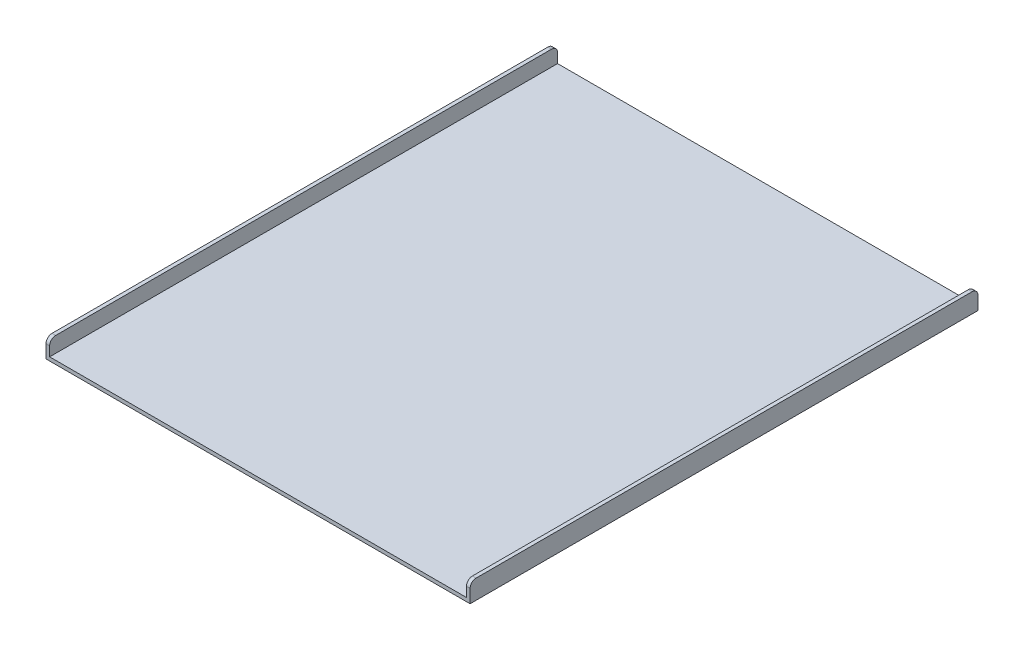
ISO-10303-21;
HEADER;
FILE_DESCRIPTION(('STEP AP214'),'2;1');
FILE_NAME('part.step','',(''),(''),'','','');
FILE_SCHEMA(('AUTOMOTIVE_DESIGN { 1 0 10303 214 1 1 1 1 }'));
ENDSEC;
DATA;
#1=APPLICATION_CONTEXT('core data for automotive mechanical design processes');
#2=APPLICATION_PROTOCOL_DEFINITION('international standard','automotive_design',2000,#1);
#3=PRODUCT_CONTEXT('',#1,'mechanical');
#4=PRODUCT('Part','Part','',(#3));
#5=PRODUCT_RELATED_PRODUCT_CATEGORY('part','',(#4));
#6=PRODUCT_DEFINITION_FORMATION('','',#4);
#7=PRODUCT_DEFINITION_CONTEXT('part definition',#1,'design');
#8=PRODUCT_DEFINITION('design','',#6,#7);
#9=PRODUCT_DEFINITION_SHAPE('','',#8);
#10=(LENGTH_UNIT() NAMED_UNIT(*) SI_UNIT(.MILLI.,.METRE.));
#11=(NAMED_UNIT(*) PLANE_ANGLE_UNIT() SI_UNIT($,.RADIAN.));
#12=(NAMED_UNIT(*) SI_UNIT($,.STERADIAN.) SOLID_ANGLE_UNIT());
#13=UNCERTAINTY_MEASURE_WITH_UNIT(LENGTH_MEASURE(1.E-05),#10,'distance_accuracy_value','');
#14=(GEOMETRIC_REPRESENTATION_CONTEXT(3) GLOBAL_UNCERTAINTY_ASSIGNED_CONTEXT((#13)) GLOBAL_UNIT_ASSIGNED_CONTEXT((#10,
#11,#12)) REPRESENTATION_CONTEXT('',''));
#15=CARTESIAN_POINT('',(0.,0.,0.));
#16=DIRECTION('',(0.,0.,1.));
#17=DIRECTION('',(1.,0.,0.));
#18=AXIS2_PLACEMENT_3D('',#15,#16,#17);
#19=CARTESIAN_POINT('',(446.551474958623,0.,421.049210887177));
#20=DIRECTION('',(-1.,0.,0.));
#21=DIRECTION('',(0.,0.,1.));
#22=AXIS2_PLACEMENT_3D('',#19,#20,#21);
#23=PLANE('',#22);
#24=DIRECTION('',(0.,1.,0.));
#25=VECTOR('',#24,1.);
#26=CARTESIAN_POINT('',(446.551474958623,0.,-421.049210887177));
#27=LINE('',#26,#25);
#28=CARTESIAN_POINT('',(446.551474958623,-6.04818389811423,-421.049210887177));
#29=VERTEX_POINT('',#28);
#30=CARTESIAN_POINT('',(446.551474958623,15.9156712813162,-421.049210887177));
#31=VERTEX_POINT('',#30);
#32=EDGE_CURVE('E165',#29,#31,#27,.T.);
#33=ORIENTED_EDGE('',*,*,#32,.T.);
#34=CARTESIAN_POINT('',(446.551474958623,15.9156712813162,-411.049210887177));
#35=DIRECTION('',(-1.,0.,0.));
#36=DIRECTION('',(0.,0.,1.));
#37=AXIS2_PLACEMENT_3D('',#34,#35,#36);
#38=CIRCLE('',#37,10.);
#39=CARTESIAN_POINT('',(446.551474958623,25.9156712813162,-411.049210887177));
#40=VERTEX_POINT('',#39);
#41=EDGE_CURVE('E214',#31,#40,#38,.F.);
#42=ORIENTED_EDGE('',*,*,#41,.T.);
#43=DIRECTION('',(0.,0.,-1.));
#44=VECTOR('',#43,1.);
#45=CARTESIAN_POINT('',(446.551474958623,25.9156712813162,421.049210887177));
#46=LINE('',#45,#44);
#47=CARTESIAN_POINT('',(446.551474958623,25.9156712813162,411.049210887177));
#48=VERTEX_POINT('',#47);
#49=EDGE_CURVE('E191',#48,#40,#46,.T.);
#50=ORIENTED_EDGE('',*,*,#49,.F.);
#51=CARTESIAN_POINT('',(446.551474958623,15.9156712813162,411.049210887177));
#52=DIRECTION('',(-1.,0.,0.));
#53=DIRECTION('',(0.,0.,1.));
#54=AXIS2_PLACEMENT_3D('',#51,#52,#53);
#55=CIRCLE('',#54,10.);
#56=CARTESIAN_POINT('',(446.551474958623,15.9156712813162,421.049210887177));
#57=VERTEX_POINT('',#56);
#58=EDGE_CURVE('E212',#48,#57,#55,.F.);
#59=ORIENTED_EDGE('',*,*,#58,.T.);
#60=DIRECTION('',(0.,1.,0.));
#61=VECTOR('',#60,1.);
#62=CARTESIAN_POINT('',(446.551474958623,0.,421.049210887177));
#63=LINE('',#62,#61);
#64=CARTESIAN_POINT('',(446.551474958623,-6.04818389811423,421.049210887177));
#65=VERTEX_POINT('',#64);
#66=EDGE_CURVE('E150',#65,#57,#63,.T.);
#67=ORIENTED_EDGE('',*,*,#66,.F.);
#68=DIRECTION('',(0.,0.,-1.));
#69=VECTOR('',#68,1.);
#70=CARTESIAN_POINT('',(446.551474958623,-6.04818389811423,421.049210887177));
#71=LINE('',#70,#69);
#72=EDGE_CURVE('E164',#65,#29,#71,.T.);
#73=ORIENTED_EDGE('',*,*,#72,.T.);
#74=EDGE_LOOP('',(#33,#42,#50,#59,#67,#73));
#75=FACE_BOUND('',#74,.T.);
#76=ADVANCED_FACE('F41',(#75),#23,.F.);
#77=CARTESIAN_POINT('',(440.503291060509,25.9156712813162,421.049210887177));
#78=DIRECTION('',(0.,1.,0.));
#79=DIRECTION('',(0.,0.,1.));
#80=AXIS2_PLACEMENT_3D('',#77,#78,#79);
#81=PLANE('',#80);
#82=ORIENTED_EDGE('',*,*,#49,.T.);
#83=DIRECTION('',(1.,0.,0.));
#84=VECTOR('',#83,1.);
#85=CARTESIAN_POINT('',(440.503291060509,25.9156712813162,-411.049210887177));
#86=LINE('',#85,#84);
#87=CARTESIAN_POINT('',(440.503291060509,25.9156712813162,-411.049210887177));
#88=VERTEX_POINT('',#87);
#89=EDGE_CURVE('E64',#40,#88,#86,.F.);
#90=ORIENTED_EDGE('',*,*,#89,.T.);
#91=DIRECTION('',(0.,0.,-1.));
#92=VECTOR('',#91,1.);
#93=CARTESIAN_POINT('',(440.503291060509,25.9156712813162,421.049210887177));
#94=LINE('',#93,#92);
#95=CARTESIAN_POINT('',(440.503291060509,25.9156712813162,411.049210887177));
#96=VERTEX_POINT('',#95);
#97=EDGE_CURVE('E143',#96,#88,#94,.T.);
#98=ORIENTED_EDGE('',*,*,#97,.F.);
#99=DIRECTION('',(1.,0.,0.));
#100=VECTOR('',#99,1.);
#101=CARTESIAN_POINT('',(446.551474958623,25.9156712813162,411.049210887177));
#102=LINE('',#101,#100);
#103=EDGE_CURVE('E216',#96,#48,#102,.T.);
#104=ORIENTED_EDGE('',*,*,#103,.T.);
#105=EDGE_LOOP('',(#82,#90,#98,#104));
#106=FACE_BOUND('',#105,.T.);
#107=ADVANCED_FACE('F252',(#106),#81,.T.);
#108=CARTESIAN_POINT('',(440.503291060509,0.,421.049210887177));
#109=DIRECTION('',(-1.,0.,0.));
#110=DIRECTION('',(0.,0.,1.));
#111=AXIS2_PLACEMENT_3D('',#108,#109,#110);
#112=PLANE('',#111);
#113=ORIENTED_EDGE('',*,*,#97,.T.);
#114=CARTESIAN_POINT('',(440.503291060509,15.9156712813162,-411.049210887177));
#115=DIRECTION('',(-1.,0.,0.));
#116=DIRECTION('',(0.,0.,1.));
#117=AXIS2_PLACEMENT_3D('',#114,#115,#116);
#118=CIRCLE('',#117,10.);
#119=CARTESIAN_POINT('',(440.503291060509,15.9156712813162,-421.049210887177));
#120=VERTEX_POINT('',#119);
#121=EDGE_CURVE('E222',#88,#120,#118,.T.);
#122=ORIENTED_EDGE('',*,*,#121,.T.);
#123=DIRECTION('',(0.,1.,0.));
#124=VECTOR('',#123,1.);
#125=CARTESIAN_POINT('',(440.503291060509,0.,-421.049210887177));
#126=LINE('',#125,#124);
#127=CARTESIAN_POINT('',(440.503291060509,0.,-421.049210887177));
#128=VERTEX_POINT('',#127);
#129=EDGE_CURVE('E138',#128,#120,#126,.T.);
#130=ORIENTED_EDGE('',*,*,#129,.F.);
#131=DIRECTION('',(0.,0.,-1.));
#132=VECTOR('',#131,1.);
#133=CARTESIAN_POINT('',(440.503291060509,0.,421.049210887177));
#134=LINE('',#133,#132);
#135=CARTESIAN_POINT('',(440.503291060509,0.,421.049210887177));
#136=VERTEX_POINT('',#135);
#137=EDGE_CURVE('E133',#136,#128,#134,.T.);
#138=ORIENTED_EDGE('',*,*,#137,.F.);
#139=DIRECTION('',(0.,1.,0.));
#140=VECTOR('',#139,1.);
#141=CARTESIAN_POINT('',(440.503291060509,0.,421.049210887177));
#142=LINE('',#141,#140);
#143=CARTESIAN_POINT('',(440.503291060509,15.9156712813162,421.049210887177));
#144=VERTEX_POINT('',#143);
#145=EDGE_CURVE('E135',#136,#144,#142,.T.);
#146=ORIENTED_EDGE('',*,*,#145,.T.);
#147=CARTESIAN_POINT('',(440.503291060509,15.9156712813162,411.049210887177));
#148=DIRECTION('',(-1.,0.,0.));
#149=DIRECTION('',(0.,0.,1.));
#150=AXIS2_PLACEMENT_3D('',#147,#148,#149);
#151=CIRCLE('',#150,10.);
#152=EDGE_CURVE('E220',#144,#96,#151,.T.);
#153=ORIENTED_EDGE('',*,*,#152,.T.);
#154=EDGE_LOOP('',(#113,#122,#130,#138,#146,#153));
#155=FACE_BOUND('',#154,.T.);
#156=ADVANCED_FACE('F134',(#155),#112,.T.);
#157=CARTESIAN_POINT('',(-250.514148936986,0.,421.049210887177));
#158=DIRECTION('',(0.,1.,0.));
#159=DIRECTION('',(0.,0.,1.));
#160=AXIS2_PLACEMENT_3D('',#157,#158,#159);
#161=PLANE('',#160);
#162=DIRECTION('',(1.,0.,0.));
#163=VECTOR('',#162,1.);
#164=CARTESIAN_POINT('',(-250.514148936986,0.,-421.049210887177));
#165=LINE('',#164,#163);
#166=CARTESIAN_POINT('',(-250.514148936986,0.,-421.049210887177));
#167=VERTEX_POINT('',#166);
#168=EDGE_CURVE('E170',#167,#128,#165,.T.);
#169=ORIENTED_EDGE('',*,*,#168,.F.);
#170=DIRECTION('',(0.,0.,-1.));
#171=VECTOR('',#170,1.);
#172=CARTESIAN_POINT('',(-250.514148936986,0.,421.049210887177));
#173=LINE('',#172,#171);
#174=CARTESIAN_POINT('',(-250.514148936986,0.,421.049210887177));
#175=VERTEX_POINT('',#174);
#176=EDGE_CURVE('E144',#175,#167,#173,.T.);
#177=ORIENTED_EDGE('',*,*,#176,.F.);
#178=DIRECTION('',(1.,0.,0.));
#179=VECTOR('',#178,1.);
#180=CARTESIAN_POINT('',(-250.514148936986,0.,421.049210887177));
#181=LINE('',#180,#179);
#182=EDGE_CURVE('E149',#175,#136,#181,.T.);
#183=ORIENTED_EDGE('',*,*,#182,.T.);
#184=ORIENTED_EDGE('',*,*,#137,.T.);
#185=EDGE_LOOP('',(#169,#177,#183,#184));
#186=FACE_BOUND('',#185,.T.);
#187=ADVANCED_FACE('F153',(#186),#161,.T.);
#188=CARTESIAN_POINT('',(-250.514148936986,25.7536347583907,421.049210887177));
#189=DIRECTION('',(1.,0.,0.));
#190=DIRECTION('',(0.,0.,-1.));
#191=AXIS2_PLACEMENT_3D('',#188,#189,#190);
#192=PLANE('',#191);
#193=DIRECTION('',(0.,-1.,0.));
#194=VECTOR('',#193,1.);
#195=CARTESIAN_POINT('',(-250.514148936986,25.7536347583907,-421.049210887177));
#196=LINE('',#195,#194);
#197=CARTESIAN_POINT('',(-250.514148936986,15.7536347583907,-421.049210887177));
#198=VERTEX_POINT('',#197);
#199=EDGE_CURVE('E172',#198,#167,#196,.T.);
#200=ORIENTED_EDGE('',*,*,#199,.F.);
#201=CARTESIAN_POINT('',(-250.514148936986,15.7536347583907,-411.049210887177));
#202=DIRECTION('',(1.,0.,0.));
#203=DIRECTION('',(0.,0.,-1.));
#204=AXIS2_PLACEMENT_3D('',#201,#202,#203);
#205=CIRCLE('',#204,10.);
#206=CARTESIAN_POINT('',(-250.514148936986,25.7536347583907,-411.049210887177));
#207=VERTEX_POINT('',#206);
#208=EDGE_CURVE('E201',#198,#207,#205,.T.);
#209=ORIENTED_EDGE('',*,*,#208,.T.);
#210=DIRECTION('',(0.,0.,-1.));
#211=VECTOR('',#210,1.);
#212=CARTESIAN_POINT('',(-250.514148936986,25.7536347583907,421.049210887177));
#213=LINE('',#212,#211);
#214=CARTESIAN_POINT('',(-250.514148936986,25.7536347583907,411.049210887177));
#215=VERTEX_POINT('',#214);
#216=EDGE_CURVE('E186',#215,#207,#213,.T.);
#217=ORIENTED_EDGE('',*,*,#216,.F.);
#218=CARTESIAN_POINT('',(-250.514148936986,15.7536347583907,411.049210887177));
#219=DIRECTION('',(1.,0.,0.));
#220=DIRECTION('',(0.,0.,-1.));
#221=AXIS2_PLACEMENT_3D('',#218,#219,#220);
#222=CIRCLE('',#221,10.);
#223=CARTESIAN_POINT('',(-250.514148936986,15.7536347583907,421.049210887177));
#224=VERTEX_POINT('',#223);
#225=EDGE_CURVE('E199',#215,#224,#222,.T.);
#226=ORIENTED_EDGE('',*,*,#225,.T.);
#227=DIRECTION('',(0.,-1.,0.));
#228=VECTOR('',#227,1.);
#229=CARTESIAN_POINT('',(-250.514148936986,25.7536347583907,421.049210887177));
#230=LINE('',#229,#228);
#231=EDGE_CURVE('E155',#224,#175,#230,.T.);
#232=ORIENTED_EDGE('',*,*,#231,.T.);
#233=ORIENTED_EDGE('',*,*,#176,.T.);
#234=EDGE_LOOP('',(#200,#209,#217,#226,#232,#233));
#235=FACE_BOUND('',#234,.T.);
#236=ADVANCED_FACE('F315',(#235),#192,.T.);
#237=CARTESIAN_POINT('',(-256.5623328351,25.7536347583907,421.049210887177));
#238=DIRECTION('',(0.,1.,0.));
#239=DIRECTION('',(0.,0.,1.));
#240=AXIS2_PLACEMENT_3D('',#237,#238,#239);
#241=PLANE('',#240);
#242=ORIENTED_EDGE('',*,*,#216,.T.);
#243=DIRECTION('',(1.,0.,0.));
#244=VECTOR('',#243,1.);
#245=CARTESIAN_POINT('',(-256.5623328351,25.7536347583907,-411.049210887177));
#246=LINE('',#245,#244);
#247=CARTESIAN_POINT('',(-256.5623328351,25.7536347583907,-411.049210887177));
#248=VERTEX_POINT('',#247);
#249=EDGE_CURVE('E206',#207,#248,#246,.F.);
#250=ORIENTED_EDGE('',*,*,#249,.T.);
#251=DIRECTION('',(0.,0.,-1.));
#252=VECTOR('',#251,1.);
#253=CARTESIAN_POINT('',(-256.5623328351,25.7536347583907,421.049210887177));
#254=LINE('',#253,#252);
#255=CARTESIAN_POINT('',(-256.5623328351,25.7536347583907,411.049210887177));
#256=VERTEX_POINT('',#255);
#257=EDGE_CURVE('E183',#256,#248,#254,.T.);
#258=ORIENTED_EDGE('',*,*,#257,.F.);
#259=DIRECTION('',(1.,0.,0.));
#260=VECTOR('',#259,1.);
#261=CARTESIAN_POINT('',(-250.514148936986,25.7536347583907,411.049210887177));
#262=LINE('',#261,#260);
#263=EDGE_CURVE('E203',#256,#215,#262,.T.);
#264=ORIENTED_EDGE('',*,*,#263,.T.);
#265=EDGE_LOOP('',(#242,#250,#258,#264));
#266=FACE_BOUND('',#265,.T.);
#267=ADVANCED_FACE('F309',(#266),#241,.T.);
#268=CARTESIAN_POINT('',(-256.5623328351,25.7536347583907,421.049210887177));
#269=DIRECTION('',(1.,0.,0.));
#270=DIRECTION('',(0.,0.,-1.));
#271=AXIS2_PLACEMENT_3D('',#268,#269,#270);
#272=PLANE('',#271);
#273=ORIENTED_EDGE('',*,*,#257,.T.);
#274=CARTESIAN_POINT('',(-256.5623328351,15.7536347583907,-411.049210887177));
#275=DIRECTION('',(1.,0.,0.));
#276=DIRECTION('',(0.,0.,-1.));
#277=AXIS2_PLACEMENT_3D('',#274,#275,#276);
#278=CIRCLE('',#277,10.);
#279=CARTESIAN_POINT('',(-256.5623328351,15.7536347583907,-421.049210887177));
#280=VERTEX_POINT('',#279);
#281=EDGE_CURVE('E210',#248,#280,#278,.F.);
#282=ORIENTED_EDGE('',*,*,#281,.T.);
#283=DIRECTION('',(0.,1.,0.));
#284=VECTOR('',#283,1.);
#285=CARTESIAN_POINT('',(-256.5623328351,25.7536347583907,-421.049210887177));
#286=LINE('',#285,#284);
#287=CARTESIAN_POINT('',(-256.5623328351,-6.04818389811423,-421.049210887177));
#288=VERTEX_POINT('',#287);
#289=EDGE_CURVE('E174',#280,#288,#286,.F.);
#290=ORIENTED_EDGE('',*,*,#289,.T.);
#291=DIRECTION('',(0.,0.,-1.));
#292=VECTOR('',#291,1.);
#293=CARTESIAN_POINT('',(-256.5623328351,-6.04818389811423,421.049210887177));
#294=LINE('',#293,#292);
#295=CARTESIAN_POINT('',(-256.5623328351,-6.04818389811423,421.049210887177));
#296=VERTEX_POINT('',#295);
#297=EDGE_CURVE('E180',#296,#288,#294,.T.);
#298=ORIENTED_EDGE('',*,*,#297,.F.);
#299=DIRECTION('',(0.,1.,0.));
#300=VECTOR('',#299,1.);
#301=CARTESIAN_POINT('',(-256.5623328351,25.7536347583907,421.049210887177));
#302=LINE('',#301,#300);
#303=CARTESIAN_POINT('',(-256.5623328351,15.7536347583907,421.049210887177));
#304=VERTEX_POINT('',#303);
#305=EDGE_CURVE('E157',#304,#296,#302,.F.);
#306=ORIENTED_EDGE('',*,*,#305,.F.);
#307=CARTESIAN_POINT('',(-256.5623328351,15.7536347583907,411.049210887177));
#308=DIRECTION('',(1.,0.,0.));
#309=DIRECTION('',(0.,0.,-1.));
#310=AXIS2_PLACEMENT_3D('',#307,#308,#309);
#311=CIRCLE('',#310,10.);
#312=EDGE_CURVE('E208',#304,#256,#311,.F.);
#313=ORIENTED_EDGE('',*,*,#312,.T.);
#314=EDGE_LOOP('',(#273,#282,#290,#298,#306,#313));
#315=FACE_BOUND('',#314,.T.);
#316=ADVANCED_FACE('F234',(#315),#272,.F.);
#317=CARTESIAN_POINT('',(-250.514148936986,-6.04818389811423,421.049210887177));
#318=DIRECTION('',(0.,1.,0.));
#319=DIRECTION('',(0.,0.,1.));
#320=AXIS2_PLACEMENT_3D('',#317,#318,#319);
#321=PLANE('',#320);
#322=CARTESIAN_POINT('',(-174.060500889895,-6.04818389811423,351.274172880699));
#323=DIRECTION('',(0.,1.,0.));
#324=DIRECTION('',(0.,0.,1.));
#325=AXIS2_PLACEMENT_3D('',#322,#323,#324);
#326=CIRCLE('',#325,19.0499999999603);
#327=CARTESIAN_POINT('',(-174.060500889895,-6.04818389811423,370.324172880659));
#328=VERTEX_POINT('',#327);
#329=EDGE_CURVE('E12',#328,#328,#326,.F.);
#330=ORIENTED_EDGE('',*,*,#329,.F.);
#331=EDGE_LOOP('',(#330));
#332=FACE_BOUND('',#331,.T.);
#333=CARTESIAN_POINT('',(360.164689426128,-6.04818389811423,-358.012657815124));
#334=DIRECTION('',(0.,1.,0.));
#335=DIRECTION('',(0.,0.,1.));
#336=AXIS2_PLACEMENT_3D('',#333,#334,#335);
#337=CIRCLE('',#336,19.05);
#338=CARTESIAN_POINT('',(360.164689426128,-6.04818389811423,-338.962657815124));
#339=VERTEX_POINT('',#338);
#340=EDGE_CURVE('E49',#339,#339,#337,.F.);
#341=ORIENTED_EDGE('',*,*,#340,.F.);
#342=EDGE_LOOP('',(#341));
#343=FACE_BOUND('',#342,.T.);
#344=DIRECTION('',(1.,0.,0.));
#345=VECTOR('',#344,1.);
#346=CARTESIAN_POINT('',(-250.514148936986,-6.04818389811423,-421.049210887177));
#347=LINE('',#346,#345);
#348=EDGE_CURVE('E176',#288,#29,#347,.T.);
#349=ORIENTED_EDGE('',*,*,#348,.T.);
#350=ORIENTED_EDGE('',*,*,#72,.F.);
#351=DIRECTION('',(1.,0.,0.));
#352=VECTOR('',#351,1.);
#353=CARTESIAN_POINT('',(-250.514148936986,-6.04818389811423,421.049210887177));
#354=LINE('',#353,#352);
#355=EDGE_CURVE('E162',#296,#65,#354,.T.);
#356=ORIENTED_EDGE('',*,*,#355,.F.);
#357=ORIENTED_EDGE('',*,*,#297,.T.);
#358=EDGE_LOOP('',(#349,#350,#356,#357));
#359=FACE_BOUND('',#358,.T.);
#360=ADVANCED_FACE('F231',(#332,#343,#359),#321,.F.);
#361=CARTESIAN_POINT('',(0.,0.,421.049210887177));
#362=DIRECTION('',(0.,0.,-1.));
#363=DIRECTION('',(-1.,0.,0.));
#364=AXIS2_PLACEMENT_3D('',#361,#362,#363);
#365=PLANE('',#364);
#366=ORIENTED_EDGE('',*,*,#66,.T.);
#367=DIRECTION('',(1.,0.,0.));
#368=VECTOR('',#367,1.);
#369=CARTESIAN_POINT('',(440.503291060509,15.9156712813162,421.049210887177));
#370=LINE('',#369,#368);
#371=EDGE_CURVE('E56',#57,#144,#370,.F.);
#372=ORIENTED_EDGE('',*,*,#371,.T.);
#373=ORIENTED_EDGE('',*,*,#145,.F.);
#374=ORIENTED_EDGE('',*,*,#182,.F.);
#375=ORIENTED_EDGE('',*,*,#231,.F.);
#376=DIRECTION('',(1.,0.,0.));
#377=VECTOR('',#376,1.);
#378=CARTESIAN_POINT('',(-256.5623328351,15.7536347583907,421.049210887177));
#379=LINE('',#378,#377);
#380=EDGE_CURVE('E224',#224,#304,#379,.F.);
#381=ORIENTED_EDGE('',*,*,#380,.T.);
#382=ORIENTED_EDGE('',*,*,#305,.T.);
#383=ORIENTED_EDGE('',*,*,#355,.T.);
#384=EDGE_LOOP('',(#366,#372,#373,#374,#375,#381,#382,#383));
#385=FACE_BOUND('',#384,.T.);
#386=ADVANCED_FACE('F147',(#385),#365,.F.);
#387=CARTESIAN_POINT('',(0.,0.,-421.049210887177));
#388=DIRECTION('',(0.,0.,-1.));
#389=DIRECTION('',(-1.,0.,0.));
#390=AXIS2_PLACEMENT_3D('',#387,#388,#389);
#391=PLANE('',#390);
#392=ORIENTED_EDGE('',*,*,#289,.F.);
#393=DIRECTION('',(1.,0.,0.));
#394=VECTOR('',#393,1.);
#395=CARTESIAN_POINT('',(0.,15.7536347583907,-421.049210887177));
#396=LINE('',#395,#394);
#397=EDGE_CURVE('E196',#280,#198,#396,.T.);
#398=ORIENTED_EDGE('',*,*,#397,.T.);
#399=ORIENTED_EDGE('',*,*,#199,.T.);
#400=ORIENTED_EDGE('',*,*,#168,.T.);
#401=ORIENTED_EDGE('',*,*,#129,.T.);
#402=DIRECTION('',(1.,0.,0.));
#403=VECTOR('',#402,1.);
#404=CARTESIAN_POINT('',(0.,15.9156712813162,-421.049210887177));
#405=LINE('',#404,#403);
#406=EDGE_CURVE('E193',#120,#31,#405,.T.);
#407=ORIENTED_EDGE('',*,*,#406,.T.);
#408=ORIENTED_EDGE('',*,*,#32,.F.);
#409=ORIENTED_EDGE('',*,*,#348,.F.);
#410=EDGE_LOOP('',(#392,#398,#399,#400,#401,#407,#408,#409));
#411=FACE_BOUND('',#410,.T.);
#412=ADVANCED_FACE('F246',(#411),#391,.T.);
#413=CARTESIAN_POINT('',(0.,15.7536347583907,-411.049210887177));
#414=DIRECTION('',(1.,0.,0.));
#415=DIRECTION('',(0.,0.,-1.));
#416=AXIS2_PLACEMENT_3D('',#413,#414,#415);
#417=CYLINDRICAL_SURFACE('',#416,10.);
#418=ORIENTED_EDGE('',*,*,#281,.F.);
#419=ORIENTED_EDGE('',*,*,#249,.F.);
#420=ORIENTED_EDGE('',*,*,#208,.F.);
#421=ORIENTED_EDGE('',*,*,#397,.F.);
#422=EDGE_LOOP('',(#418,#419,#420,#421));
#423=FACE_BOUND('',#422,.T.);
#424=ADVANCED_FACE('F286',(#423),#417,.T.);
#425=CARTESIAN_POINT('',(0.,15.9156712813162,-411.049210887177));
#426=DIRECTION('',(1.,0.,0.));
#427=DIRECTION('',(0.,0.,-1.));
#428=AXIS2_PLACEMENT_3D('',#425,#426,#427);
#429=CYLINDRICAL_SURFACE('',#428,10.);
#430=ORIENTED_EDGE('',*,*,#121,.F.);
#431=ORIENTED_EDGE('',*,*,#89,.F.);
#432=ORIENTED_EDGE('',*,*,#41,.F.);
#433=ORIENTED_EDGE('',*,*,#406,.F.);
#434=EDGE_LOOP('',(#430,#431,#432,#433));
#435=FACE_BOUND('',#434,.T.);
#436=ADVANCED_FACE('F250',(#435),#429,.T.);
#437=CARTESIAN_POINT('',(440.503291060509,15.9156712813162,411.049210887177));
#438=DIRECTION('',(-1.,0.,0.));
#439=DIRECTION('',(0.,0.,1.));
#440=AXIS2_PLACEMENT_3D('',#437,#438,#439);
#441=CYLINDRICAL_SURFACE('',#440,10.);
#442=ORIENTED_EDGE('',*,*,#152,.F.);
#443=ORIENTED_EDGE('',*,*,#371,.F.);
#444=ORIENTED_EDGE('',*,*,#58,.F.);
#445=ORIENTED_EDGE('',*,*,#103,.F.);
#446=EDGE_LOOP('',(#442,#443,#444,#445));
#447=FACE_BOUND('',#446,.T.);
#448=ADVANCED_FACE('F255',(#447),#441,.T.);
#449=CARTESIAN_POINT('',(-256.5623328351,15.7536347583907,411.049210887177));
#450=DIRECTION('',(-1.,0.,0.));
#451=DIRECTION('',(0.,0.,1.));
#452=AXIS2_PLACEMENT_3D('',#449,#450,#451);
#453=CYLINDRICAL_SURFACE('',#452,10.);
#454=ORIENTED_EDGE('',*,*,#312,.F.);
#455=ORIENTED_EDGE('',*,*,#380,.F.);
#456=ORIENTED_EDGE('',*,*,#225,.F.);
#457=ORIENTED_EDGE('',*,*,#263,.F.);
#458=EDGE_LOOP('',(#454,#455,#456,#457));
#459=FACE_BOUND('',#458,.T.);
#460=ADVANCED_FACE('F43',(#459),#453,.T.);
#461=CARTESIAN_POINT('',(360.164689426128,-29.2979254583527,-358.012657815124));
#462=DIRECTION('',(0.,1.,0.));
#463=DIRECTION('',(0.,0.,1.));
#464=AXIS2_PLACEMENT_3D('',#461,#462,#463);
#465=CYLINDRICAL_SURFACE('',#464,19.05);
#466=CARTESIAN_POINT('',(360.164689426128,-29.2979254583527,-358.012657815124));
#467=DIRECTION('',(0.,-1.,0.));
#468=DIRECTION('',(0.,0.,-1.));
#469=AXIS2_PLACEMENT_3D('',#466,#467,#468);
#470=CIRCLE('',#469,19.05);
#471=CARTESIAN_POINT('',(360.164689426128,-29.2979254583527,-377.062657815124));
#472=VERTEX_POINT('',#471);
#473=EDGE_CURVE('E168',#472,#472,#470,.T.);
#474=ORIENTED_EDGE('',*,*,#473,.F.);
#475=EDGE_LOOP('',(#474));
#476=FACE_BOUND('',#475,.T.);
#477=ORIENTED_EDGE('',*,*,#340,.T.);
#478=EDGE_LOOP('',(#477));
#479=FACE_BOUND('',#478,.T.);
#480=ADVANCED_FACE('F229',(#476,#479),#465,.T.);
#481=CARTESIAN_POINT('',(360.164689426128,-29.2979254583527,-358.012657815124));
#482=DIRECTION('',(0.,-1.,0.));
#483=DIRECTION('',(0.,0.,-1.));
#484=AXIS2_PLACEMENT_3D('',#481,#482,#483);
#485=PLANE('',#484);
#486=ORIENTED_EDGE('',*,*,#473,.T.);
#487=EDGE_LOOP('',(#486));
#488=FACE_BOUND('',#487,.T.);
#489=ADVANCED_FACE('F268',(#488),#485,.T.);
#490=CARTESIAN_POINT('',(-174.060500889895,-29.0481838981142,351.274172880699));
#491=DIRECTION('',(0.,1.,0.));
#492=DIRECTION('',(0.,0.,1.));
#493=AXIS2_PLACEMENT_3D('',#490,#491,#492);
#494=CYLINDRICAL_SURFACE('',#493,19.0499999999603);
#495=CARTESIAN_POINT('',(-174.060500889895,-29.0481838981142,351.274172880699));
#496=DIRECTION('',(0.,-1.,0.));
#497=DIRECTION('',(0.,0.,-1.));
#498=AXIS2_PLACEMENT_3D('',#495,#496,#497);
#499=CIRCLE('',#498,19.0499999999603);
#500=CARTESIAN_POINT('',(-174.060500889895,-29.0481838981142,332.224172880739));
#501=VERTEX_POINT('',#500);
#502=EDGE_CURVE('E259',#501,#501,#499,.T.);
#503=ORIENTED_EDGE('',*,*,#502,.F.);
#504=EDGE_LOOP('',(#503));
#505=FACE_BOUND('',#504,.T.);
#506=ORIENTED_EDGE('',*,*,#329,.T.);
#507=EDGE_LOOP('',(#506));
#508=FACE_BOUND('',#507,.T.);
#509=ADVANCED_FACE('F265',(#505,#508),#494,.T.);
#510=CARTESIAN_POINT('',(0.,-29.0481838981142,0.));
#511=DIRECTION('',(0.,-1.,0.));
#512=DIRECTION('',(0.,0.,-1.));
#513=AXIS2_PLACEMENT_3D('',#510,#511,#512);
#514=PLANE('',#513);
#515=ORIENTED_EDGE('',*,*,#502,.T.);
#516=EDGE_LOOP('',(#515));
#517=FACE_BOUND('',#516,.T.);
#518=ADVANCED_FACE('F263',(#517),#514,.T.);
#519=CLOSED_SHELL('',(#76,#107,#156,#187,#236,#267,#316,#360,#386,#412,#424,#436,#448,#460,#480,
#489,#509,#518));
#520=MANIFOLD_SOLID_BREP('B2',#519);
#521=ADVANCED_BREP_SHAPE_REPRESENTATION('',(#18,#520),#14);
#522=SHAPE_DEFINITION_REPRESENTATION(#9,#521);
ENDSEC;
END-ISO-10303-21;
